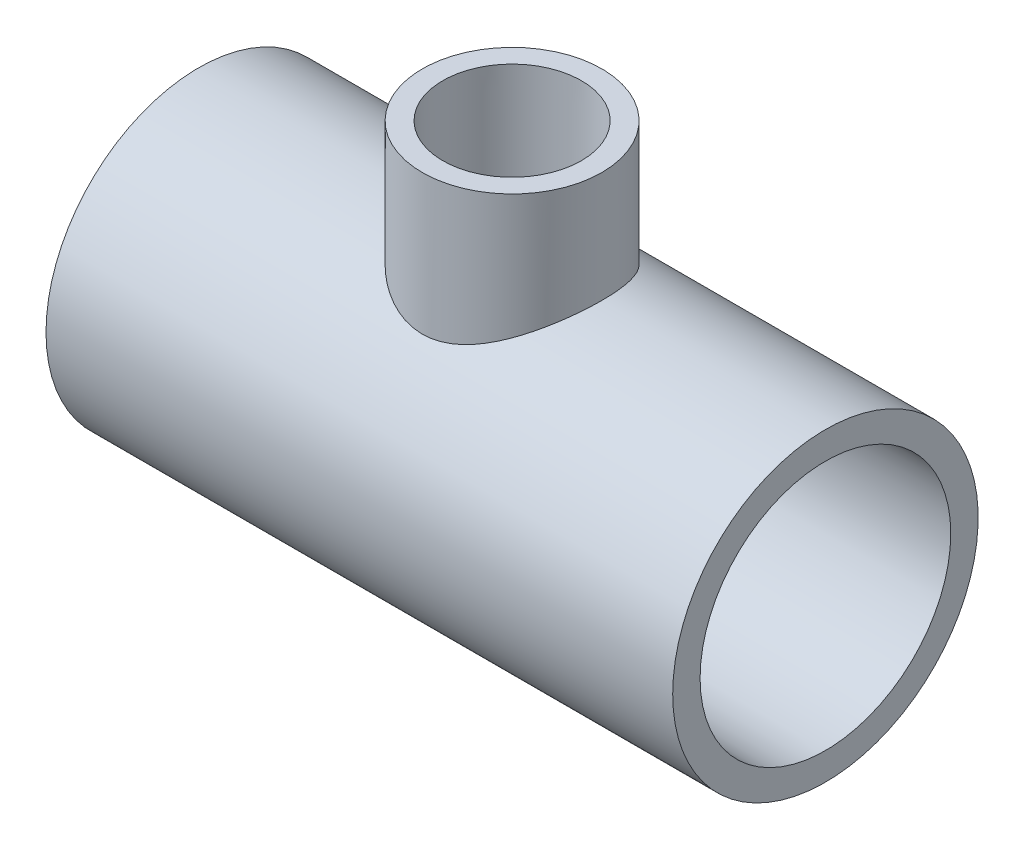
ISO-10303-21;
HEADER;
FILE_DESCRIPTION(('STEP AP214'),'2;1');
FILE_NAME('part.step','',(''),(''),'','','');
FILE_SCHEMA(('AUTOMOTIVE_DESIGN { 1 0 10303 214 1 1 1 1 }'));
ENDSEC;
DATA;
#1=APPLICATION_CONTEXT('core data for automotive mechanical design processes');
#2=APPLICATION_PROTOCOL_DEFINITION('international standard','automotive_design',2000,#1);
#3=PRODUCT_CONTEXT('',#1,'mechanical');
#4=PRODUCT('Part','Part','',(#3));
#5=PRODUCT_RELATED_PRODUCT_CATEGORY('part','',(#4));
#6=PRODUCT_DEFINITION_FORMATION('','',#4);
#7=PRODUCT_DEFINITION_CONTEXT('part definition',#1,'design');
#8=PRODUCT_DEFINITION('design','',#6,#7);
#9=PRODUCT_DEFINITION_SHAPE('','',#8);
#10=(LENGTH_UNIT() NAMED_UNIT(*) SI_UNIT(.MILLI.,.METRE.));
#11=(NAMED_UNIT(*) PLANE_ANGLE_UNIT() SI_UNIT($,.RADIAN.));
#12=(NAMED_UNIT(*) SI_UNIT($,.STERADIAN.) SOLID_ANGLE_UNIT());
#13=UNCERTAINTY_MEASURE_WITH_UNIT(LENGTH_MEASURE(1.E-05),#10,'distance_accuracy_value','');
#14=(GEOMETRIC_REPRESENTATION_CONTEXT(3) GLOBAL_UNCERTAINTY_ASSIGNED_CONTEXT((#13)) GLOBAL_UNIT_ASSIGNED_CONTEXT((#10,
#11,#12)) REPRESENTATION_CONTEXT('',''));
#15=CARTESIAN_POINT('',(0.,0.,0.));
#16=DIRECTION('',(0.,0.,1.));
#17=DIRECTION('',(1.,0.,0.));
#18=AXIS2_PLACEMENT_3D('',#15,#16,#17);
#19=CARTESIAN_POINT('',(-25.908,0.,0.));
#20=DIRECTION('',(1.,0.,0.));
#21=DIRECTION('',(0.,0.,-1.));
#22=AXIS2_PLACEMENT_3D('',#19,#20,#21);
#23=PLANE('',#22);
#24=CARTESIAN_POINT('',(-25.908,0.,0.));
#25=DIRECTION('',(-1.,0.,0.));
#26=DIRECTION('',(0.,0.,1.));
#27=AXIS2_PLACEMENT_3D('',#24,#25,#26);
#28=CIRCLE('',#27,24.0538);
#29=CARTESIAN_POINT('',(-25.908,0.,24.0538));
#30=VERTEX_POINT('',#29);
#31=EDGE_CURVE('E93',#30,#30,#28,.T.);
#32=ORIENTED_EDGE('',*,*,#31,.T.);
#33=EDGE_LOOP('',(#32));
#34=FACE_BOUND('',#33,.T.);
#35=CARTESIAN_POINT('',(-25.908,0.,0.));
#36=DIRECTION('',(1.,0.,0.));
#37=DIRECTION('',(0.,0.,-1.));
#38=AXIS2_PLACEMENT_3D('',#35,#36,#37);
#39=CIRCLE('',#38,19.05);
#40=CARTESIAN_POINT('',(-25.908,0.,-19.05));
#41=VERTEX_POINT('',#40);
#42=EDGE_CURVE('E96',#41,#41,#39,.T.);
#43=ORIENTED_EDGE('',*,*,#42,.T.);
#44=EDGE_LOOP('',(#43));
#45=FACE_BOUND('',#44,.T.);
#46=ADVANCED_FACE('F31',(#34,#45),#23,.F.);
#47=CARTESIAN_POINT('',(25.908,0.,0.));
#48=DIRECTION('',(1.,0.,0.));
#49=DIRECTION('',(0.,0.,-1.));
#50=AXIS2_PLACEMENT_3D('',#47,#48,#49);
#51=PLANE('',#50);
#52=CARTESIAN_POINT('',(25.908,0.,0.));
#53=DIRECTION('',(1.,0.,0.));
#54=DIRECTION('',(0.,0.,-1.));
#55=AXIS2_PLACEMENT_3D('',#52,#53,#54);
#56=CIRCLE('',#55,24.0538);
#57=CARTESIAN_POINT('',(25.908,0.,-24.0538));
#58=VERTEX_POINT('',#57);
#59=EDGE_CURVE('E10',#58,#58,#56,.F.);
#60=ORIENTED_EDGE('',*,*,#59,.F.);
#61=EDGE_LOOP('',(#60));
#62=FACE_BOUND('',#61,.T.);
#63=CARTESIAN_POINT('',(25.908,0.,0.));
#64=DIRECTION('',(1.,0.,0.));
#65=DIRECTION('',(0.,0.,-1.));
#66=AXIS2_PLACEMENT_3D('',#63,#64,#65);
#67=CIRCLE('',#66,19.05);
#68=CARTESIAN_POINT('',(25.908,0.,-19.05));
#69=VERTEX_POINT('',#68);
#70=EDGE_CURVE('E99',#69,#69,#67,.T.);
#71=ORIENTED_EDGE('',*,*,#70,.F.);
#72=EDGE_LOOP('',(#71));
#73=FACE_BOUND('',#72,.T.);
#74=ADVANCED_FACE('F69',(#62,#73),#51,.T.);
#75=CARTESIAN_POINT('',(25.908,0.,0.));
#76=DIRECTION('',(-1.,0.,0.));
#77=DIRECTION('',(0.,0.,1.));
#78=AXIS2_PLACEMENT_3D('',#75,#76,#77);
#79=CYLINDRICAL_SURFACE('',#78,29.591);
#80=CARTESIAN_POINT('',(-60.706,0.,0.));
#81=DIRECTION('',(-1.,0.,0.));
#82=DIRECTION('',(0.,0.,1.));
#83=AXIS2_PLACEMENT_3D('',#80,#81,#82);
#84=CIRCLE('',#83,29.591);
#85=CARTESIAN_POINT('',(-60.706,0.,29.591));
#86=VERTEX_POINT('',#85);
#87=EDGE_CURVE('E110',#86,#86,#84,.T.);
#88=ORIENTED_EDGE('',*,*,#87,.F.);
#89=EDGE_LOOP('',(#88));
#90=FACE_BOUND('',#89,.T.);
#91=CARTESIAN_POINT('',(60.706,0.,0.));
#92=DIRECTION('',(-1.,0.,0.));
#93=DIRECTION('',(0.,0.,1.));
#94=AXIS2_PLACEMENT_3D('',#91,#92,#93);
#95=CIRCLE('',#94,29.591);
#96=CARTESIAN_POINT('',(60.706,0.,29.591));
#97=VERTEX_POINT('',#96);
#98=EDGE_CURVE('E98',#97,#97,#95,.T.);
#99=ORIENTED_EDGE('',*,*,#98,.T.);
#100=EDGE_LOOP('',(#99));
#101=FACE_BOUND('',#100,.T.);
#102=CARTESIAN_POINT('',(17.399,29.591,0.));
#103=CARTESIAN_POINT('',(17.3989965746656,29.5909968547931,-0.446664263788673));
#104=CARTESIAN_POINT('',(17.3817716950422,29.5808599173466,-0.893483619711497));
#105=CARTESIAN_POINT('',(17.3130851748739,29.5405525594495,-1.78377449229501));
#106=CARTESIAN_POINT('',(17.2616010772573,29.5103689983717,-2.22724361989634));
#107=CARTESIAN_POINT('',(17.1249205436222,29.4306285259771,-3.10829157522697));
#108=CARTESIAN_POINT('',(17.0396434612983,29.381025273377,-3.54585370388858));
#109=CARTESIAN_POINT('',(16.8365009384491,29.2636801942943,-4.41075641610078));
#110=CARTESIAN_POINT('',(16.7186405534614,29.195941181759,-4.83809857418761));
#111=CARTESIAN_POINT('',(16.4523864578326,29.0442970785563,-5.67778349241128));
#112=CARTESIAN_POINT('',(16.3041469685307,28.960473772525,-6.09019009433338));
#113=CARTESIAN_POINT('',(15.9783265080964,28.7783036112216,-6.89991037613747));
#114=CARTESIAN_POINT('',(15.8007445062871,28.6799562457944,-7.29722352524792));
#115=CARTESIAN_POINT('',(15.417952544002,28.4708562205587,-8.07462602232387));
#116=CARTESIAN_POINT('',(15.2127560773021,28.3601096240342,-8.45472366213837));
#117=CARTESIAN_POINT('',(14.7762443765361,28.1283712213738,-9.19635720524652));
#118=CARTESIAN_POINT('',(14.5449265172563,28.0073783857917,-9.55789123756694));
#119=CARTESIAN_POINT('',(14.0394793333617,27.748126558282,-10.2873491853061));
#120=CARTESIAN_POINT('',(13.7634428055843,27.609252931579,-10.6537332565626));
#121=CARTESIAN_POINT('',(13.18465615595,27.3253295974633,-11.3621874909861));
#122=CARTESIAN_POINT('',(12.8819048820624,27.1802796238453,-11.70425660446));
#123=CARTESIAN_POINT('',(12.2508347272961,26.8869278142573,-12.3632776276872));
#124=CARTESIAN_POINT('',(11.9224861199397,26.7386223456033,-12.680199445528));
#125=CARTESIAN_POINT('',(11.2418805583162,26.4421655726438,-13.2873364483088));
#126=CARTESIAN_POINT('',(10.8896223466983,26.2940142768624,-13.5775502268411));
#127=CARTESIAN_POINT('',(10.1199331921776,25.9841669109285,-14.1623528553039));
#128=CARTESIAN_POINT('',(9.69969563382477,25.8229098878933,-14.4534936642856));
#129=CARTESIAN_POINT('',(8.83258042492793,25.5098630349156,-14.9991046605458));
#130=CARTESIAN_POINT('',(8.38569865646792,25.3580746758307,-15.2535691585503));
#131=CARTESIAN_POINT('',(7.46786840915121,25.0695358990769,-15.723280516061));
#132=CARTESIAN_POINT('',(6.99695170011867,24.9327663466049,-15.9385775124567));
#133=CARTESIAN_POINT('',(6.03309183371566,24.6796348682849,-16.3277946055125));
#134=CARTESIAN_POINT('',(5.5401565462078,24.563265723026,-16.5017293474795));
#135=CARTESIAN_POINT('',(4.65275524424181,24.3804848044472,-16.7701845883971));
#136=CARTESIAN_POINT('',(4.26210615512665,24.3087505052862,-16.8737658714764));
#137=CARTESIAN_POINT('',(3.47186551006263,24.182719236169,-17.0538996289054));
#138=CARTESIAN_POINT('',(3.07227531591813,24.1284196298438,-17.130456189945));
#139=CARTESIAN_POINT('',(2.26698346930766,24.0391628728771,-17.2554874469854));
#140=CARTESIAN_POINT('',(1.86128831970376,24.004186456866,-17.3039901152075));
#141=CARTESIAN_POINT('',(1.04622107477816,23.9547744465798,-17.3723302363024));
#142=CARTESIAN_POINT('',(0.636848911491327,23.9403392327732,-17.392167158222));
#143=CARTESIAN_POINT('',(-0.183170986888116,23.9325564723725,-17.402875316488));
#144=CARTESIAN_POINT('',(-0.593819708148509,23.9392446710061,-17.3936974537302));
#145=CARTESIAN_POINT('',(-1.41255916154233,23.9735289517119,-17.346412618511));
#146=CARTESIAN_POINT('',(-1.82064988209232,24.0011251283933,-17.3083055151442));
#147=CARTESIAN_POINT('',(-2.63155660073567,24.0762132177497,-17.2037019825753));
#148=CARTESIAN_POINT('',(-3.03436917745361,24.1237174351664,-17.1371879951888));
#149=CARTESIAN_POINT('',(-3.83185036098813,24.2369410670221,-16.9766777085311));
#150=CARTESIAN_POINT('',(-4.22651877590705,24.3026609101433,-16.8826807624797));
#151=CARTESIAN_POINT('',(-5.00195096147245,24.449497631376,-16.6693111828854));
#152=CARTESIAN_POINT('',(-5.38280893143271,24.5304680884988,-16.5501786651237));
#153=CARTESIAN_POINT('',(-6.13280410945582,24.7058768579449,-16.2871698929305));
#154=CARTESIAN_POINT('',(-6.50193743007998,24.8003195813158,-16.1432855311366));
#155=CARTESIAN_POINT('',(-7.22705000103735,25.0002167198022,-15.8319503259858));
#156=CARTESIAN_POINT('',(-7.5830283203365,25.1056719123027,-15.664497818631));
#157=CARTESIAN_POINT('',(-8.28076069034228,25.3251532026764,-15.3071182552408));
#158=CARTESIAN_POINT('',(-8.62251398891438,25.4391797528598,-15.1171900128574));
#159=CARTESIAN_POINT('',(-9.34743105043381,25.6932408774167,-14.6819075911772));
#160=CARTESIAN_POINT('',(-9.72783341125569,25.834414272369,-14.4326108453873));
#161=CARTESIAN_POINT('',(-10.4667000406405,26.1216007917485,-13.906083949146));
#162=CARTESIAN_POINT('',(-10.8251679811925,26.2676130997607,-13.6288584948509));
#163=CARTESIAN_POINT('',(-11.5194037588907,26.5612446028436,-13.0473653366527));
#164=CARTESIAN_POINT('',(-11.8551494899446,26.7088652050323,-12.7430719462372));
#165=CARTESIAN_POINT('',(-12.5022950243176,27.0023386845443,-12.1088032493395));
#166=CARTESIAN_POINT('',(-12.8136935648323,27.1481914698459,-11.7788266125253));
#167=CARTESIAN_POINT('',(-13.4490747524633,27.4534585372452,-11.050347615996));
#168=CARTESIAN_POINT('',(-13.7695404080466,27.6122098948425,-10.6484864685149));
#169=CARTESIAN_POINT('',(-14.375358588756,27.9192555958272,-9.81527331455823));
#170=CARTESIAN_POINT('',(-14.6607076282546,28.0675489005399,-9.38391838717003));
#171=CARTESIAN_POINT('',(-15.1935550080529,28.3495169359491,-8.49410741444208));
#172=CARTESIAN_POINT('',(-15.441068956411,28.4831976882225,-8.03566265324478));
#173=CARTESIAN_POINT('',(-15.8955648002813,28.7321231201475,-7.09431384450719));
#174=CARTESIAN_POINT('',(-16.1025517538802,28.8473701001493,-6.61141285877658));
#175=CARTESIAN_POINT('',(-16.460957046543,29.0490056131473,-5.65724266500031));
#176=CARTESIAN_POINT('',(-16.6151416690875,29.1367969762516,-5.18730999615828));
#177=CARTESIAN_POINT('',(-16.8835844748139,29.2907048808839,-4.23267677349769));
#178=CARTESIAN_POINT('',(-16.9978439509851,29.3568221243313,-3.74797669847937));
#179=CARTESIAN_POINT('',(-17.1845681925219,29.4653303350277,-2.76842601051983));
#180=CARTESIAN_POINT('',(-17.2570713751992,29.5077431101857,-2.27358516302387));
#181=CARTESIAN_POINT('',(-17.3592095128774,29.5675920351085,-1.27802031914324));
#182=CARTESIAN_POINT('',(-17.3888499491436,29.5850313784595,-0.7772970832527));
#183=CARTESIAN_POINT('',(-17.4037335703595,29.5937838498572,0.159932073074027));
#184=CARTESIAN_POINT('',(-17.3942405314551,29.5881945750429,0.596336485935011));
#185=CARTESIAN_POINT('',(-17.3425628256558,29.5578435633911,1.46650052629275));
#186=CARTESIAN_POINT('',(-17.3003815741966,29.533083829584,1.90026042533028));
#187=CARTESIAN_POINT('',(-17.183885962684,29.4649926439974,2.76193824720278));
#188=CARTESIAN_POINT('',(-17.1095721975676,29.421661536069,3.18985627804925));
#189=CARTESIAN_POINT('',(-16.9297403562719,29.3174491069984,4.03689990040177));
#190=CARTESIAN_POINT('',(-16.8242214244781,29.2565673046349,4.45602525048378));
#191=CARTESIAN_POINT('',(-16.5853923195237,29.1198886253071,5.27529396642916));
#192=CARTESIAN_POINT('',(-16.4526217036858,29.0443827218165,5.67564383191115));
#193=CARTESIAN_POINT('',(-16.1595160709122,28.8793589583378,6.46310708283081));
#194=CARTESIAN_POINT('',(-15.9991817616653,28.7898414580982,6.85022080779627));
#195=CARTESIAN_POINT('',(-15.6523531401934,28.5985544219556,7.60941758252167));
#196=CARTESIAN_POINT('',(-15.4658568707956,28.4967839694916,7.9814995050697));
#197=CARTESIAN_POINT('',(-15.0681246171143,28.2828985367166,8.70911997128292));
#198=CARTESIAN_POINT('',(-14.8568857029643,28.1707823316614,9.06465654877433));
#199=CARTESIAN_POINT('',(-14.3878098643102,27.9260994213197,9.79403982834691));
#200=CARTESIAN_POINT('',(-14.1274109576203,27.7926191202922,10.1659336025434));
#201=CARTESIAN_POINT('',(-13.5798504602151,27.5183260467884,10.8865833189193));
#202=CARTESIAN_POINT('',(-13.2926872953399,27.3775128432371,11.2353378980819));
#203=CARTESIAN_POINT('',(-12.692818891668,27.09133010119,11.908868125047));
#204=CARTESIAN_POINT('',(-12.3800863778009,26.9459558019036,12.2336174444248));
#205=CARTESIAN_POINT('',(-11.7307242171677,26.6538530368038,12.8576084414388));
#206=CARTESIAN_POINT('',(-11.394093804887,26.5071245277425,13.1568493012932));
#207=CARTESIAN_POINT('',(-10.6554310385994,26.1976034974641,13.7638177004128));
#208=CARTESIAN_POINT('',(-10.2504421926362,26.035049260963,14.0680804244378));
#209=CARTESIAN_POINT('',(-9.41348172310059,25.7170349848117,14.6413413781848));
#210=CARTESIAN_POINT('',(-8.98150594827487,25.5615760429886,14.9103341627046));
#211=CARTESIAN_POINT('',(-8.09279373061582,25.2630245882162,15.4107656643246));
#212=CARTESIAN_POINT('',(-7.63608115340961,25.1199204895769,15.6422397471565));
#213=CARTESIAN_POINT('',(-6.69973271093483,24.8513100237714,16.0655707252056));
#214=CARTESIAN_POINT('',(-6.22010396736232,24.7257982364991,16.2574398311744));
#215=CARTESIAN_POINT('',(-5.34659389220293,24.5224126037075,16.5621399943347));
#216=CARTESIAN_POINT('',(-4.95656255712508,24.4401045091803,16.6830916186141));
#217=CARTESIAN_POINT('',(-4.16600586764178,24.2921186561806,16.8978486504583));
#218=CARTESIAN_POINT('',(-3.76548196334606,24.2264386128938,16.9916577878501));
#219=CARTESIAN_POINT('',(-2.95665651625204,24.1139737296945,17.1508913040656));
#220=CARTESIAN_POINT('',(-2.5483639956226,24.0671682232272,17.2163467344627));
#221=CARTESIAN_POINT('',(-1.72631297213413,23.9940550573819,17.3180989802318));
#222=CARTESIAN_POINT('',(-1.31255441419512,23.9677476047185,17.3543955015482));
#223=CARTESIAN_POINT('',(-0.481436826144142,23.9366021264239,17.3973296488002));
#224=CARTESIAN_POINT('',(-0.0640707179942435,23.9318287545176,17.4038779593948));
#225=CARTESIAN_POINT('',(0.769727069320339,23.9441179301538,17.3869664269358));
#226=CARTESIAN_POINT('',(1.18615874560217,23.9611805449708,17.3635064914298));
#227=CARTESIAN_POINT('',(2.01506342727834,24.0164824172342,17.2869333422075));
#228=CARTESIAN_POINT('',(2.42753428161926,24.0547325852393,17.2338048505137));
#229=CARTESIAN_POINT('',(3.24535475657933,24.1509723683366,17.0986744360324));
#230=CARTESIAN_POINT('',(3.6507043024898,24.2089621903849,17.0166722105243));
#231=CARTESIAN_POINT('',(4.43782918502563,24.340317012428,16.8282185728146));
#232=CARTESIAN_POINT('',(4.81993428509567,24.4130778869863,16.7227155000701));
#233=CARTESIAN_POINT('',(5.57344176531732,24.5729465048072,16.4868996482894));
#234=CARTESIAN_POINT('',(5.94484061661545,24.6600589163171,16.3565787944032));
#235=CARTESIAN_POINT('',(6.67537149679943,24.8462848567974,16.0722825827001));
#236=CARTESIAN_POINT('',(7.03450263809015,24.945399251789,15.918305517718));
#237=CARTESIAN_POINT('',(7.73933200083425,25.1532485337519,15.5877988759396));
#238=CARTESIAN_POINT('',(8.08502959537253,25.261983868938,15.4112682482608));
#239=CARTESIAN_POINT('',(8.81458010276175,25.5041728760546,15.0076007942296));
#240=CARTESIAN_POINT('',(9.19603836116555,25.6388450879914,14.7768613553395));
#241=CARTESIAN_POINT('',(9.93851164261207,25.9144217711739,14.2880625246462));
#242=CARTESIAN_POINT('',(10.2995299324729,26.0553252400608,14.0300075175802));
#243=CARTESIAN_POINT('',(11.0003885830906,26.3402361053555,13.4875191761485));
#244=CARTESIAN_POINT('',(11.3402113912079,26.4842459448478,13.2030644518539));
#245=CARTESIAN_POINT('',(11.9972209364959,26.772153366898,12.6090462009431));
#246=CARTESIAN_POINT('',(12.3144063679841,26.9160509425081,12.2994812282103));
#247=CARTESIAN_POINT('',(12.9697139080606,27.2216760138727,11.6090589301529));
#248=CARTESIAN_POINT('',(13.304077907426,27.3829212028489,11.2244060536504));
#249=CARTESIAN_POINT('',(13.9392784134358,27.6971004350157,10.4250821706966));
#250=CARTESIAN_POINT('',(14.2401110256226,27.8500335117526,10.010407686633));
#251=CARTESIAN_POINT('',(14.8059126742722,28.1435358758749,9.15282041409932));
#252=CARTESIAN_POINT('',(15.0708666505924,28.2840999627319,8.70989588164738));
#253=CARTESIAN_POINT('',(15.5620557452478,28.5488504666771,7.79843139624327));
#254=CARTESIAN_POINT('',(15.7882963924149,28.6730392218209,7.32989511365701));
#255=CARTESIAN_POINT('',(16.1904550933099,28.8964736446356,6.39091984776526));
#256=CARTESIAN_POINT('',(16.3681205377625,28.9965630893886,5.92143151989442));
#257=CARTESIAN_POINT('',(16.6831364445004,29.1755428386295,4.96503787433314));
#258=CARTESIAN_POINT('',(16.8204799386022,29.2544294787844,4.47812956252299));
#259=CARTESIAN_POINT('',(17.0523029088384,29.3883342499189,3.49277934489417));
#260=CARTESIAN_POINT('',(17.1469265975722,29.4434326567501,2.9943823041291));
#261=CARTESIAN_POINT('',(17.2923354387059,29.5283494909458,1.98939487330724));
#262=CARTESIAN_POINT('',(17.3431590317104,29.5581900851013,1.48281206605863));
#263=CARTESIAN_POINT('',(17.3807783248501,29.5802893246539,0.812538758447441));
#264=CARTESIAN_POINT('',(17.3876089748947,29.5843035256523,0.650140880734595));
#265=CARTESIAN_POINT('',(17.396720469854,29.5896594557198,0.325168854190197));
#266=CARTESIAN_POINT('',(17.39900124689,29.5910011449181,0.162594702765055));
#267=CARTESIAN_POINT('',(17.399,29.591,0.));
#268=B_SPLINE_CURVE_WITH_KNOTS('',3,(#102,#103,#104,#105,#106,#107,#108,#109,#110,#111,#112,
#113,#114,#115,#116,#117,#118,#119,#120,#121,#122,#123,#124,#125,#126,#127,#128,#129,#130,#131,
#132,#133,#134,#135,#136,#137,#138,#139,#140,#141,#142,#143,#144,#145,#146,#147,#148,#149,#150,
#151,#152,#153,#154,#155,#156,#157,#158,#159,#160,#161,#162,#163,#164,#165,#166,#167,#168,#169,
#170,#171,#172,#173,#174,#175,#176,#177,#178,#179,#180,#181,#182,#183,#184,#185,#186,#187,#188,
#189,#190,#191,#192,#193,#194,#195,#196,#197,#198,#199,#200,#201,#202,#203,#204,#205,#206,#207,
#208,#209,#210,#211,#212,#213,#214,#215,#216,#217,#218,#219,#220,#221,#222,#223,#224,#225,#226,
#227,#228,#229,#230,#231,#232,#233,#234,#235,#236,#237,#238,#239,#240,#241,#242,#243,#244,#245,
#246,#247,#248,#249,#250,#251,#252,#253,#254,#255,#256,#257,#258,#259,#260,#261,#262,#263,#264,
#265,#266,#267),.UNSPECIFIED.,.T.,.F.,(4,2,2,2,2,2,2,2,2,2,2,2,2,2,2,2,2,2,2,2,2,2,2,2,2,2,2,2,
2,2,2,2,2,2,2,2,2,2,2,2,2,2,2,2,2,2,2,2,2,2,2,2,2,2,2,2,2,2,2,2,2,2,2,2,2,2,2,2,2,2,2,2,2,2,2,2,
2,2,2,2,2,2,4),(0.,1.33981815372604,2.68051543057583,4.0244317126321,5.36813959316862,
6.70518791766087,8.04228321692554,9.37872750260515,10.7153062213726,12.1517210832592,
13.5881979185328,15.0263685394961,16.4646148492173,18.0708456806304,19.6773254049876,
21.2817340373858,22.8855737414306,24.115727323007,25.3456948004713,26.5744337675986,
27.803195493405,29.0340376542115,30.2648853846434,31.4964950008306,32.7281336038889,
33.9485000509373,35.1692669876357,36.3901201582516,37.6110377985393,39.0382732954857,
40.4652692049367,41.8936340316022,43.322072893516,44.9338999869598,46.5458869393459,
48.1572070958271,49.7683260185458,51.2730888400343,52.7778029247535,54.2811303969759,
55.7842656074777,57.09227764214,58.400153027273,59.7080041979908,61.0158912320087,
62.3000241525773,63.5841241083694,64.868320178793,66.1526684695755,67.5708586227457,
68.9891322405322,70.4089389925305,71.8287912453417,73.42288063689,75.017215845251,
76.6100393561053,78.2023710419259,79.450839352726,80.6991360217395,81.9460621405234,
83.1930008338878,84.443680843588,85.6943647065199,86.9456932103137,88.1970348337956,
89.4049044805911,90.6131678000479,91.8215183555781,93.0299252347037,94.4256937219024,
95.8212384969832,97.2179240280965,98.6146900524837,100.216427617583,101.818351020905,
103.420944764753,105.023309443318,106.556676973052,108.09030933386,109.618725053909,
111.14579800904,111.633511269705,112.121231806415),.UNSPECIFIED.);
#269=CARTESIAN_POINT('',(17.399,29.591,0.));
#270=VERTEX_POINT('',#269);
#271=EDGE_CURVE('E53',#270,#270,#268,.T.);
#272=ORIENTED_EDGE('',*,*,#271,.F.);
#273=EDGE_LOOP('',(#272));
#274=FACE_BOUND('',#273,.T.);
#275=ADVANCED_FACE('F65',(#90,#101,#274),#79,.T.);
#276=CARTESIAN_POINT('',(0.,0.,0.));
#277=DIRECTION('',(0.,-1.,0.));
#278=DIRECTION('',(1.,0.,0.));
#279=AXIS2_PLACEMENT_3D('',#276,#277,#278);
#280=CYLINDRICAL_SURFACE('',#279,17.399);
#281=CARTESIAN_POINT('',(0.,51.054,0.));
#282=DIRECTION('',(0.,-1.,0.));
#283=DIRECTION('',(1.,0.,0.));
#284=AXIS2_PLACEMENT_3D('',#281,#282,#283);
#285=CIRCLE('',#284,17.399);
#286=CARTESIAN_POINT('',(17.399,51.054,0.));
#287=VERTEX_POINT('',#286);
#288=EDGE_CURVE('E44',#287,#287,#285,.T.);
#289=ORIENTED_EDGE('',*,*,#288,.T.);
#290=EDGE_LOOP('',(#289));
#291=FACE_BOUND('',#290,.T.);
#292=ORIENTED_EDGE('',*,*,#271,.T.);
#293=EDGE_LOOP('',(#292));
#294=FACE_BOUND('',#293,.T.);
#295=ADVANCED_FACE('F62',(#291,#294),#280,.T.);
#296=CARTESIAN_POINT('',(0.,51.054,0.));
#297=DIRECTION('',(0.,1.,0.));
#298=DIRECTION('',(-1.,0.,0.));
#299=AXIS2_PLACEMENT_3D('',#296,#297,#298);
#300=CONICAL_SURFACE('',#299,13.4366,0.00594052417839499);
#301=CARTESIAN_POINT('',(0.,51.054,0.));
#302=DIRECTION('',(0.,-1.,0.));
#303=DIRECTION('',(1.,0.,0.));
#304=AXIS2_PLACEMENT_3D('',#301,#302,#303);
#305=CIRCLE('',#304,13.4366);
#306=CARTESIAN_POINT('',(13.4366,51.054,0.));
#307=VERTEX_POINT('',#306);
#308=EDGE_CURVE('E48',#307,#307,#305,.T.);
#309=ORIENTED_EDGE('',*,*,#308,.F.);
#310=EDGE_LOOP('',(#309));
#311=FACE_BOUND('',#310,.T.);
#312=CARTESIAN_POINT('',(0.,25.4,0.));
#313=DIRECTION('',(0.,-1.,0.));
#314=DIRECTION('',(1.,0.,0.));
#315=AXIS2_PLACEMENT_3D('',#312,#313,#314);
#316=CIRCLE('',#315,13.2842);
#317=CARTESIAN_POINT('',(13.2842,25.4,0.));
#318=VERTEX_POINT('',#317);
#319=EDGE_CURVE('E153',#318,#318,#316,.T.);
#320=ORIENTED_EDGE('',*,*,#319,.T.);
#321=EDGE_LOOP('',(#320));
#322=FACE_BOUND('',#321,.T.);
#323=ADVANCED_FACE('F72',(#311,#322),#300,.F.);
#324=CARTESIAN_POINT('',(17.399,51.054,0.));
#325=DIRECTION('',(0.,1.,0.));
#326=DIRECTION('',(-1.,0.,0.));
#327=AXIS2_PLACEMENT_3D('',#324,#325,#326);
#328=PLANE('',#327);
#329=ORIENTED_EDGE('',*,*,#308,.T.);
#330=EDGE_LOOP('',(#329));
#331=FACE_BOUND('',#330,.T.);
#332=ORIENTED_EDGE('',*,*,#288,.F.);
#333=EDGE_LOOP('',(#332));
#334=FACE_BOUND('',#333,.T.);
#335=ADVANCED_FACE('F33',(#331,#334),#328,.T.);
#336=CARTESIAN_POINT('',(-60.706,-29.591,0.));
#337=DIRECTION('',(-1.,0.,0.));
#338=DIRECTION('',(0.,0.,1.));
#339=AXIS2_PLACEMENT_3D('',#336,#337,#338);
#340=PLANE('',#339);
#341=ORIENTED_EDGE('',*,*,#87,.T.);
#342=EDGE_LOOP('',(#341));
#343=FACE_BOUND('',#342,.T.);
#344=CARTESIAN_POINT('',(-60.706,0.,0.));
#345=DIRECTION('',(-1.,0.,0.));
#346=DIRECTION('',(0.,0.,1.));
#347=AXIS2_PLACEMENT_3D('',#344,#345,#346);
#348=CIRCLE('',#347,24.2824);
#349=CARTESIAN_POINT('',(-60.706,0.,24.2824));
#350=VERTEX_POINT('',#349);
#351=EDGE_CURVE('E60',#350,#350,#348,.T.);
#352=ORIENTED_EDGE('',*,*,#351,.F.);
#353=EDGE_LOOP('',(#352));
#354=FACE_BOUND('',#353,.T.);
#355=ADVANCED_FACE('F79',(#343,#354),#340,.T.);
#356=CARTESIAN_POINT('',(-25.908,0.,0.));
#357=DIRECTION('',(-1.,0.,0.));
#358=DIRECTION('',(0.,0.,1.));
#359=AXIS2_PLACEMENT_3D('',#356,#357,#358);
#360=CONICAL_SURFACE('',#359,24.0538,0.00656924856536312);
#361=ORIENTED_EDGE('',*,*,#351,.T.);
#362=EDGE_LOOP('',(#361));
#363=FACE_BOUND('',#362,.T.);
#364=ORIENTED_EDGE('',*,*,#31,.F.);
#365=EDGE_LOOP('',(#364));
#366=FACE_BOUND('',#365,.T.);
#367=ADVANCED_FACE('F115',(#363,#366),#360,.F.);
#368=CARTESIAN_POINT('',(60.706,-29.591,0.));
#369=DIRECTION('',(1.,0.,0.));
#370=DIRECTION('',(0.,0.,-1.));
#371=AXIS2_PLACEMENT_3D('',#368,#369,#370);
#372=PLANE('',#371);
#373=CARTESIAN_POINT('',(60.706,0.,0.));
#374=DIRECTION('',(-1.,0.,0.));
#375=DIRECTION('',(0.,0.,1.));
#376=AXIS2_PLACEMENT_3D('',#373,#374,#375);
#377=CIRCLE('',#376,24.2824);
#378=CARTESIAN_POINT('',(60.706,0.,24.2824));
#379=VERTEX_POINT('',#378);
#380=EDGE_CURVE('E102',#379,#379,#377,.T.);
#381=ORIENTED_EDGE('',*,*,#380,.T.);
#382=EDGE_LOOP('',(#381));
#383=FACE_BOUND('',#382,.T.);
#384=ORIENTED_EDGE('',*,*,#98,.F.);
#385=EDGE_LOOP('',(#384));
#386=FACE_BOUND('',#385,.T.);
#387=ADVANCED_FACE('F124',(#383,#386),#372,.T.);
#388=CARTESIAN_POINT('',(60.706,0.,0.));
#389=DIRECTION('',(1.,0.,0.));
#390=DIRECTION('',(0.,0.,-1.));
#391=AXIS2_PLACEMENT_3D('',#388,#389,#390);
#392=CONICAL_SURFACE('',#391,24.2824,0.00656924856536293);
#393=ORIENTED_EDGE('',*,*,#59,.T.);
#394=EDGE_LOOP('',(#393));
#395=FACE_BOUND('',#394,.T.);
#396=ORIENTED_EDGE('',*,*,#380,.F.);
#397=EDGE_LOOP('',(#396));
#398=FACE_BOUND('',#397,.T.);
#399=ADVANCED_FACE('F129',(#395,#398),#392,.F.);
#400=CARTESIAN_POINT('',(60.706,0.,0.));
#401=DIRECTION('',(1.,0.,0.));
#402=DIRECTION('',(0.,0.,-1.));
#403=AXIS2_PLACEMENT_3D('',#400,#401,#402);
#404=CYLINDRICAL_SURFACE('',#403,19.05);
#405=CARTESIAN_POINT('',(9.4234,19.05,0.));
#406=CARTESIAN_POINT('',(9.42339897824053,19.0499990754768,0.248131337728484));
#407=CARTESIAN_POINT('',(9.41358808491519,19.0451405398915,0.496284727261304));
#408=CARTESIAN_POINT('',(9.37445450632722,19.0258283757429,0.990768013201925));
#409=CARTESIAN_POINT('',(9.34512306148938,19.0113704395894,1.23709704075375));
#410=CARTESIAN_POINT('',(9.26722951849994,18.973202722697,1.72638095666143));
#411=CARTESIAN_POINT('',(9.21863587821689,18.9494777680132,1.96932963081158));
#412=CARTESIAN_POINT('',(9.1027693331464,18.8933817788057,2.44971792747523));
#413=CARTESIAN_POINT('',(9.03549504847118,18.8610101055794,2.68715714161562));
#414=CARTESIAN_POINT('',(8.88328172393525,18.7885674575911,3.15401655337843));
#415=CARTESIAN_POINT('',(8.79841386463844,18.748527555408,3.38346484126883));
#416=CARTESIAN_POINT('',(8.61165296194973,18.6616122019696,3.83397537906213));
#417=CARTESIAN_POINT('',(8.50975953568003,18.6147365969933,4.05503744023497));
#418=CARTESIAN_POINT('',(8.28984266373312,18.5152346369761,4.48751698960025));
#419=CARTESIAN_POINT('',(8.17182518338484,18.4626104101583,4.69893800623459));
#420=CARTESIAN_POINT('',(7.92045069229081,18.3527324867734,5.11128764834286));
#421=CARTESIAN_POINT('',(7.78708801638803,18.2954770827952,5.31221235871764));
#422=CARTESIAN_POINT('',(7.49754535737426,18.1740730855877,5.71421303355051));
#423=CARTESIAN_POINT('',(7.3404806599623,18.1097170556776,5.91458932732339));
#424=CARTESIAN_POINT('',(7.01107852302817,17.9787212694157,6.30157288746889));
#425=CARTESIAN_POINT('',(6.83874023168003,17.9120813858181,6.48817938481907));
#426=CARTESIAN_POINT('',(6.47960309476925,17.7780628947219,6.84687222030535));
#427=CARTESIAN_POINT('',(6.29279549832522,17.7106838616721,7.01894963784461));
#428=CARTESIAN_POINT('',(5.90567340621398,17.5768603058651,7.34765144343197));
#429=CARTESIAN_POINT('',(5.70535642737447,17.5104159576407,7.50427297741559));
#430=CARTESIAN_POINT('',(5.27646130967059,17.375229097253,7.81244731106577));
#431=CARTESIAN_POINT('',(5.04689195416616,17.3066942602976,7.96271559938776));
#432=CARTESIAN_POINT('',(4.5744910300839,17.1748825637306,8.24317406230966));
#433=CARTESIAN_POINT('',(4.33166513100397,17.1116034851069,8.3733727304998));
#434=CARTESIAN_POINT('',(3.8341052396293,16.9924715735838,8.61256452683375));
#435=CARTESIAN_POINT('',(3.57937480505368,16.9366165409189,8.72156394083003));
#436=CARTESIAN_POINT('',(3.05961145330003,16.8344401244258,8.91719258299222));
#437=CARTESIAN_POINT('',(2.79457965658598,16.7881177071797,9.00382423627612));
#438=CARTESIAN_POINT('',(2.2721765758477,16.7093433828006,9.14914040225514));
#439=CARTESIAN_POINT('',(2.01528097988528,16.6762325613734,9.20917603342146));
#440=CARTESIAN_POINT('',(1.49616097326778,16.6214903991673,9.30761757808726));
#441=CARTESIAN_POINT('',(1.2339367864851,16.5998585771472,9.34602439834875));
#442=CARTESIAN_POINT('',(0.706668764726258,16.5690135714405,9.40059984125235));
#443=CARTESIAN_POINT('',(0.441627402512291,16.5597902787465,9.41678656642838));
#444=CARTESIAN_POINT('',(-0.0890007853342831,16.5541414620486,9.42671429492923));
#445=CARTESIAN_POINT('',(-0.354587558626231,16.5577147625648,9.42045735990219));
#446=CARTESIAN_POINT('',(-0.852867693567639,16.5763332743292,9.38764924474983));
#447=CARTESIAN_POINT('',(-1.08578009541279,16.5899899402818,9.36355357591613));
#448=CARTESIAN_POINT('',(-1.5485198424912,16.6266875869062,9.29823449702514));
#449=CARTESIAN_POINT('',(-1.77834613783483,16.6497316816023,9.25700540332829));
#450=CARTESIAN_POINT('',(-2.23328260659223,16.7044478907894,9.15789902367075));
#451=CARTESIAN_POINT('',(-2.45839345660586,16.7361187582005,9.10002414394477));
#452=CARTESIAN_POINT('',(-2.90270039406976,16.8071288041294,8.96819499843693));
#453=CARTESIAN_POINT('',(-3.12189408480117,16.8464710383782,8.89423432385044));
#454=CARTESIAN_POINT('',(-3.55807816402004,16.9326665343948,8.7290420171364));
#455=CARTESIAN_POINT('',(-3.7749033861531,16.9796710568277,8.63745393427156));
#456=CARTESIAN_POINT('',(-4.20012735744607,17.0792373976819,8.43886753403507));
#457=CARTESIAN_POINT('',(-4.40852327400462,17.1318010631095,8.3318640906585));
#458=CARTESIAN_POINT('',(-4.81597992975099,17.2411474447346,8.10317198738474));
#459=CARTESIAN_POINT('',(-5.01503897794334,17.2979309204041,7.9814806815274));
#460=CARTESIAN_POINT('',(-5.40302190610802,17.4143741362262,7.72411951894604));
#461=CARTESIAN_POINT('',(-5.59194517362444,17.4740340497754,7.58844881895864));
#462=CARTESIAN_POINT('',(-5.98171967217335,17.6024165238668,7.2861261590061));
#463=CARTESIAN_POINT('',(-6.18114429145746,17.6713453912793,7.11771865621958));
#464=CARTESIAN_POINT('',(-6.56526688477584,17.8093412936653,6.76503583877416));
#465=CARTESIAN_POINT('',(-6.74996857054016,17.8784082892863,6.58076454798289));
#466=CARTESIAN_POINT('',(-7.10387628922246,18.0150054121008,6.19706206208402));
#467=CARTESIAN_POINT('',(-7.2730696101405,18.0825342450094,5.99761867134311));
#468=CARTESIAN_POINT('',(-7.59469949641481,18.2142794989546,5.58475207239357));
#469=CARTESIAN_POINT('',(-7.74714267539953,18.2784972219962,5.37133443528351));
#470=CARTESIAN_POINT('',(-8.04073209162454,18.4048107671789,4.92162523673189));
#471=CARTESIAN_POINT('',(-8.18106327859861,18.4666816974972,4.68473681544253));
#472=CARTESIAN_POINT('',(-8.44107611236239,18.5833337909237,4.19818794541441));
#473=CARTESIAN_POINT('',(-8.56075683130845,18.6381146354405,3.94852692344455));
#474=CARTESIAN_POINT('',(-8.77812765752367,18.7389511290972,3.43828260403535));
#475=CARTESIAN_POINT('',(-8.87583147580246,18.7850122154868,3.17770623755176));
#476=CARTESIAN_POINT('',(-9.04814655567361,18.8670410915406,2.64748747361076));
#477=CARTESIAN_POINT('',(-9.12276041008161,18.9030100144305,2.37784609785292));
#478=CARTESIAN_POINT('',(-9.24277912391413,18.9612363222699,1.85409777008738));
#479=CARTESIAN_POINT('',(-9.29007146132189,18.9843734564283,1.60052004556732));
#480=CARTESIAN_POINT('',(-9.36374741752675,19.0205352860686,1.08963078228823));
#481=CARTESIAN_POINT('',(-9.39013215882068,19.0335605244419,0.83231944473657));
#482=CARTESIAN_POINT('',(-9.42164111873838,19.0491250900881,0.316182363496146));
#483=CARTESIAN_POINT('',(-9.42677358128106,19.0516684833459,0.0573572460374572));
#484=CARTESIAN_POINT('',(-9.41573087046744,19.0462068350281,-0.459720547710995));
#485=CARTESIAN_POINT('',(-9.39955660150458,19.0382022411762,-0.717973247831732));
#486=CARTESIAN_POINT('',(-9.34814934468864,19.0128766283358,-1.21225283690166));
#487=CARTESIAN_POINT('',(-9.31445417332699,18.9963079004703,-1.44848043108909));
#488=CARTESIAN_POINT('',(-9.22941192852412,18.9547540051334,-1.91706562287488));
#489=CARTESIAN_POINT('',(-9.17805885034092,18.9297659746549,-2.14942187576819));
#490=CARTESIAN_POINT('',(-9.058254485075,18.8719701473405,-2.60859726882834));
#491=CARTESIAN_POINT('',(-8.98980865454866,18.8391648461816,-2.83541815074627));
#492=CARTESIAN_POINT('',(-8.83643499279375,18.766460960817,-3.28233533217646));
#493=CARTESIAN_POINT('',(-8.75150074870317,18.726559617246,-3.50242897657975));
#494=CARTESIAN_POINT('',(-8.56324110470102,18.6393126418462,-3.94079815826628));
#495=CARTESIAN_POINT('',(-8.45945898018493,18.5917866608384,-4.15884144585675));
#496=CARTESIAN_POINT('',(-8.23605034084079,18.4912035267076,-4.58540459154805));
#497=CARTESIAN_POINT('',(-8.11641845194612,18.4381444988386,-4.79392118710791));
#498=CARTESIAN_POINT('',(-7.86215967017043,18.3276424310417,-5.20042278535854));
#499=CARTESIAN_POINT('',(-7.72753023608817,18.2701986486764,-5.3984059948372));
#500=CARTESIAN_POINT('',(-7.44411486247116,18.1521426373719,-5.78296490698593));
#501=CARTESIAN_POINT('',(-7.29532821573921,18.091530250219,-5.96954003902121));
#502=CARTESIAN_POINT('',(-6.96932586332152,17.9624333909958,-6.34801027282585));
#503=CARTESIAN_POINT('',(-6.79075239888316,17.893754930844,-6.53867147899976));
#504=CARTESIAN_POINT('',(-6.41857618196134,17.7558522382939,-6.90437537373273));
#505=CARTESIAN_POINT('',(-6.22497739381835,17.6866281541567,-7.0794221560414));
#506=CARTESIAN_POINT('',(-5.82352114231055,17.5493541185803,-7.4131812435017));
#507=CARTESIAN_POINT('',(-5.61565326994066,17.4813050705813,-7.57188140851097));
#508=CARTESIAN_POINT('',(-5.18674222634115,17.3482783065085,-7.87189150433582));
#509=CARTESIAN_POINT('',(-4.96569712925348,17.2833010418777,-8.01319888389244));
#510=CARTESIAN_POINT('',(-4.50104987262755,17.1554464550711,-8.28350988906391));
#511=CARTESIAN_POINT('',(-4.25687774066037,17.0928035105168,-8.41164763231535));
#512=CARTESIAN_POINT('',(-3.75682120564242,16.975180000953,-8.64656151944173));
#513=CARTESIAN_POINT('',(-3.50094251385069,16.9201957513653,-8.75334794622245));
#514=CARTESIAN_POINT('',(-2.97925447259533,16.8200040504018,-8.94436143435227));
#515=CARTESIAN_POINT('',(-2.7134530831538,16.7747889517662,-9.02860615368514));
#516=CARTESIAN_POINT('',(-2.17381392183969,16.6959969449132,-9.173495139079));
#517=CARTESIAN_POINT('',(-1.89997736851191,16.6624182818057,-9.23414296395552));
#518=CARTESIAN_POINT('',(-1.37309986060548,16.6110017556718,-9.3262866871382));
#519=CARTESIAN_POINT('',(-1.12056362734247,16.5919688976001,-9.3600096936965));
#520=CARTESIAN_POINT('',(-0.612987448791099,16.5654334297948,-9.40689391101956));
#521=CARTESIAN_POINT('',(-0.357947673073068,16.5579300444945,-9.42005650484675));
#522=CARTESIAN_POINT('',(0.152341088077928,16.5547624438078,-9.42562194344152));
#523=CARTESIAN_POINT('',(0.407589970952524,16.5590941440355,-9.4180319500977));
#524=CARTESIAN_POINT('',(0.916159214116339,16.5794097705031,-9.38222225923339));
#525=CARTESIAN_POINT('',(1.16947964684667,16.5953932568461,-9.35400334052883));
#526=CARTESIAN_POINT('',(1.64899013261776,16.636389452462,-9.2808736088478));
#527=CARTESIAN_POINT('',(1.87553620436692,16.660438731776,-9.23773264625808));
#528=CARTESIAN_POINT('',(2.32394605790288,16.7168556618221,-9.13524258850262));
#529=CARTESIAN_POINT('',(2.54580825897742,16.7492260737007,-9.07588811290368));
#530=CARTESIAN_POINT('',(2.98349404934183,16.8213162781229,-8.94156693011412));
#531=CARTESIAN_POINT('',(3.19931840690306,16.8610351306897,-8.86660221955519));
#532=CARTESIAN_POINT('',(3.62392095181309,16.9467261833127,-8.70170091234312));
#533=CARTESIAN_POINT('',(3.83269650170815,16.9927006923819,-8.61175878464824));
#534=CARTESIAN_POINT('',(4.47437609393379,17.1447427080089,-8.3074652244034));
#535=CARTESIAN_POINT('',(4.89332536125106,17.2598981782196,-8.06758052601698));
#536=CARTESIAN_POINT('',(5.68768042060977,17.5016583545137,-7.52870708225603));
#537=CARTESIAN_POINT('',(6.06306368336649,17.6282689246798,-7.2296879709161));
#538=CARTESIAN_POINT('',(6.60951126802177,17.8256650999393,-6.72208761679903));
#539=CARTESIAN_POINT('',(6.79774496704126,17.8964768530277,-6.53168154982301));
#540=CARTESIAN_POINT('',(7.15762276565849,18.0362438667104,-6.13518790201033));
#541=CARTESIAN_POINT('',(7.32927160742277,18.105199653895,-5.92910483405638));
#542=CARTESIAN_POINT('',(7.65501039070101,18.2394950998866,-5.50213146376664));
#543=CARTESIAN_POINT('',(7.80908678238986,18.3048319484896,-5.28122994082981));
#544=CARTESIAN_POINT('',(8.09836335116611,18.4300982884361,-4.82594080523899));
#545=CARTESIAN_POINT('',(8.23356466061084,18.4900281040829,-4.59155400278864));
#546=CARTESIAN_POINT('',(8.48451887375911,18.6031309211656,-4.10945484412656));
#547=CARTESIAN_POINT('',(8.60017127799516,18.6562686836403,-3.86168178455081));
#548=CARTESIAN_POINT('',(8.809974962784,18.753908031919,-3.35556686846579));
#549=CARTESIAN_POINT('',(8.90412885495166,18.7984106666098,-3.09722630018617));
#550=CARTESIAN_POINT('',(9.06962179721367,18.8773619498159,-2.57253191029738));
#551=CARTESIAN_POINT('',(9.14101528135462,18.9118345687004,-2.3061988999093));
#552=CARTESIAN_POINT('',(9.26030607818649,18.9697804649054,-1.76728149575345));
#553=CARTESIAN_POINT('',(9.30821794324339,18.9932605542692,-1.49470108364751));
#554=CARTESIAN_POINT('',(9.37044060630513,19.0238451964419,-1.01824762334159));
#555=CARTESIAN_POINT('',(9.39028457218699,19.0336372616803,-0.815249492500585));
#556=CARTESIAN_POINT('',(9.41676486955687,19.0467151325044,-0.408172567015603));
#557=CARTESIAN_POINT('',(9.42340084042071,19.0500007604416,-0.204093743017485));
#558=CARTESIAN_POINT('',(9.4234,19.05,0.));
#559=B_SPLINE_CURVE_WITH_KNOTS('',3,(#405,#406,#407,#408,#409,#410,#411,#412,#413,#414,#415,
#416,#417,#418,#419,#420,#421,#422,#423,#424,#425,#426,#427,#428,#429,#430,#431,#432,#433,#434,
#435,#436,#437,#438,#439,#440,#441,#442,#443,#444,#445,#446,#447,#448,#449,#450,#451,#452,#453,
#454,#455,#456,#457,#458,#459,#460,#461,#462,#463,#464,#465,#466,#467,#468,#469,#470,#471,#472,
#473,#474,#475,#476,#477,#478,#479,#480,#481,#482,#483,#484,#485,#486,#487,#488,#489,#490,#491,
#492,#493,#494,#495,#496,#497,#498,#499,#500,#501,#502,#503,#504,#505,#506,#507,#508,#509,#510,
#511,#512,#513,#514,#515,#516,#517,#518,#519,#520,#521,#522,#523,#524,#525,#526,#527,#528,#529,
#530,#531,#532,#533,#534,#535,#536,#537,#538,#539,#540,#541,#542,#543,#544,#545,#546,#547,#548,
#549,#550,#551,#552,#553,#554,#555,#556,#557,#558),.UNSPECIFIED.,.T.,.F.,(4,2,2,2,2,2,2,2,2,2,2,
2,2,2,2,2,2,2,2,2,2,2,2,2,2,2,2,2,2,2,2,2,2,2,2,2,2,2,2,2,2,2,2,2,2,2,2,2,2,2,2,2,2,2,2,2,2,2,2,
2,2,2,2,2,2,2,2,2,2,2,2,2,2,2,2,2,4),(0.,0.744192465682231,1.48871910272449,2.23446998329327,
2.98027596508729,3.72312145848136,4.46598365953277,5.20857176836737,5.95143491170669,
6.73841536994254,7.5254397466408,8.31294388072678,9.10059316330869,9.94795747791535,
10.7949621921563,11.6417153743888,12.4883767128506,13.2849032310756,14.0813963533938,
14.8772401932496,15.6730109297018,16.375843513587,17.0789094331829,17.7818737719899,
18.4851186963093,19.2044543318104,19.9240297194492,20.6437349297586,21.3634835794849,
22.1724974447404,22.9813067039528,23.7907731130091,24.599918754942,25.4454109219297,
26.2909410677364,27.1359422296347,27.9808484702974,28.7567684437195,29.5326467563636,
30.3082240717589,31.0837684677721,31.8005181594156,32.5175118301674,33.2342769054155,
33.9513213136527,34.6888843391446,35.4266980879558,36.1646370434757,36.9026128807342,
37.7120395099636,38.5212532982058,39.3310637965832,40.1409929407249,40.988207731421,
41.835013510992,42.681153992618,43.5271668122666,44.2925671775757,45.0579160535446,
45.8230008346594,46.5880567325713,47.2828900518024,47.9779542312716,48.6729295628993,
49.3681621149102,50.8507843974141,52.3341700037977,53.164198737724,53.993989431876,
54.8244156987445,55.6547921251025,56.489315539314,57.3237375225686,58.1561486558492,
58.9880432609683,59.6001420003615,60.2122574519482),.UNSPECIFIED.);
#560=CARTESIAN_POINT('',(9.4234,19.05,0.));
#561=VERTEX_POINT('',#560);
#562=EDGE_CURVE('E35',#561,#561,#559,.T.);
#563=ORIENTED_EDGE('',*,*,#562,.F.);
#564=EDGE_LOOP('',(#563));
#565=FACE_BOUND('',#564,.T.);
#566=ORIENTED_EDGE('',*,*,#70,.T.);
#567=EDGE_LOOP('',(#566));
#568=FACE_BOUND('',#567,.T.);
#569=ORIENTED_EDGE('',*,*,#42,.F.);
#570=EDGE_LOOP('',(#569));
#571=FACE_BOUND('',#570,.T.);
#572=ADVANCED_FACE('F132',(#565,#568,#571),#404,.F.);
#573=CARTESIAN_POINT('',(13.2842,25.4,0.));
#574=DIRECTION('',(0.,-1.,0.));
#575=DIRECTION('',(1.,0.,0.));
#576=AXIS2_PLACEMENT_3D('',#573,#574,#575);
#577=PLANE('',#576);
#578=ORIENTED_EDGE('',*,*,#319,.F.);
#579=EDGE_LOOP('',(#578));
#580=FACE_BOUND('',#579,.T.);
#581=CARTESIAN_POINT('',(0.,25.4,0.));
#582=DIRECTION('',(0.,-1.,0.));
#583=DIRECTION('',(1.,0.,0.));
#584=AXIS2_PLACEMENT_3D('',#581,#582,#583);
#585=CIRCLE('',#584,9.4234);
#586=CARTESIAN_POINT('',(9.4234,25.4,0.));
#587=VERTEX_POINT('',#586);
#588=EDGE_CURVE('E151',#587,#587,#585,.T.);
#589=ORIENTED_EDGE('',*,*,#588,.T.);
#590=EDGE_LOOP('',(#589));
#591=FACE_BOUND('',#590,.T.);
#592=ADVANCED_FACE('F136',(#580,#591),#577,.F.);
#593=CARTESIAN_POINT('',(0.,0.,0.));
#594=DIRECTION('',(0.,-1.,0.));
#595=DIRECTION('',(1.,0.,0.));
#596=AXIS2_PLACEMENT_3D('',#593,#594,#595);
#597=CYLINDRICAL_SURFACE('',#596,9.4234);
#598=ORIENTED_EDGE('',*,*,#562,.T.);
#599=EDGE_LOOP('',(#598));
#600=FACE_BOUND('',#599,.T.);
#601=ORIENTED_EDGE('',*,*,#588,.F.);
#602=EDGE_LOOP('',(#601));
#603=FACE_BOUND('',#602,.T.);
#604=ADVANCED_FACE('F139',(#600,#603),#597,.F.);
#605=CLOSED_SHELL('',(#46,#74,#275,#295,#323,#335,#355,#367,#387,#399,#572,#592,#604));
#606=MANIFOLD_SOLID_BREP('B2',#605);
#607=ADVANCED_BREP_SHAPE_REPRESENTATION('',(#18,#606),#14);
#608=SHAPE_DEFINITION_REPRESENTATION(#9,#607);
ENDSEC;
END-ISO-10303-21;
